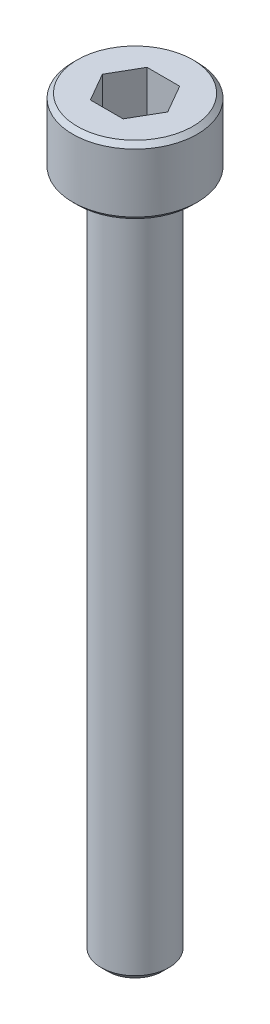
ISO-10303-21;
HEADER;
FILE_DESCRIPTION(('STEP AP214'),'2;1');
FILE_NAME('part.step','',(''),(''),'','','');
FILE_SCHEMA(('AUTOMOTIVE_DESIGN { 1 0 10303 214 1 1 1 1 }'));
ENDSEC;
DATA;
#1=APPLICATION_CONTEXT('core data for automotive mechanical design processes');
#2=APPLICATION_PROTOCOL_DEFINITION('international standard','automotive_design',2000,#1);
#3=PRODUCT_CONTEXT('',#1,'mechanical');
#4=PRODUCT('Part','Part','',(#3));
#5=PRODUCT_RELATED_PRODUCT_CATEGORY('part','',(#4));
#6=PRODUCT_DEFINITION_FORMATION('','',#4);
#7=PRODUCT_DEFINITION_CONTEXT('part definition',#1,'design');
#8=PRODUCT_DEFINITION('design','',#6,#7);
#9=PRODUCT_DEFINITION_SHAPE('','',#8);
#10=(LENGTH_UNIT() NAMED_UNIT(*) SI_UNIT(.MILLI.,.METRE.));
#11=(NAMED_UNIT(*) PLANE_ANGLE_UNIT() SI_UNIT($,.RADIAN.));
#12=(NAMED_UNIT(*) SI_UNIT($,.STERADIAN.) SOLID_ANGLE_UNIT());
#13=UNCERTAINTY_MEASURE_WITH_UNIT(LENGTH_MEASURE(1.E-05),#10,'distance_accuracy_value','');
#14=(GEOMETRIC_REPRESENTATION_CONTEXT(3) GLOBAL_UNCERTAINTY_ASSIGNED_CONTEXT((#13)) GLOBAL_UNIT_ASSIGNED_CONTEXT((#10,
#11,#12)) REPRESENTATION_CONTEXT('',''));
#15=CARTESIAN_POINT('',(0.,0.,0.));
#16=DIRECTION('',(0.,0.,1.));
#17=DIRECTION('',(1.,0.,0.));
#18=AXIS2_PLACEMENT_3D('',#15,#16,#17);
#19=CARTESIAN_POINT('',(0.721687836487033,31.,1.25));
#20=DIRECTION('',(0.866025403784439,0.,0.5));
#21=DIRECTION('',(0.5,0.,-0.866025403784439));
#22=AXIS2_PLACEMENT_3D('',#19,#20,#21);
#23=PLANE('',#22);
#24=DIRECTION('',(0.5,0.,-0.866025403784439));
#25=VECTOR('',#24,1.);
#26=CARTESIAN_POINT('',(0.721687836487033,31.,1.25));
#27=LINE('',#26,#25);
#28=CARTESIAN_POINT('',(0.721687836487033,31.,1.25));
#29=VERTEX_POINT('',#28);
#30=CARTESIAN_POINT('',(1.44337567297406,31.,0.));
#31=VERTEX_POINT('',#30);
#32=EDGE_CURVE('E66',#29,#31,#27,.T.);
#33=ORIENTED_EDGE('',*,*,#32,.F.);
#34=DIRECTION('',(0.,1.,0.));
#35=VECTOR('',#34,1.);
#36=CARTESIAN_POINT('',(0.721687836487033,31.,1.25));
#37=LINE('',#36,#35);
#38=CARTESIAN_POINT('',(0.721687836487033,33.,1.25));
#39=VERTEX_POINT('',#38);
#40=EDGE_CURVE('E85',#29,#39,#37,.T.);
#41=ORIENTED_EDGE('',*,*,#40,.T.);
#42=DIRECTION('',(0.5,0.,-0.866025403784439));
#43=VECTOR('',#42,1.);
#44=CARTESIAN_POINT('',(0.721687836487033,33.,1.25));
#45=LINE('',#44,#43);
#46=CARTESIAN_POINT('',(1.44337567297406,33.,0.));
#47=VERTEX_POINT('',#46);
#48=EDGE_CURVE('E73',#47,#39,#45,.F.);
#49=ORIENTED_EDGE('',*,*,#48,.F.);
#50=DIRECTION('',(0.,1.,0.));
#51=VECTOR('',#50,1.);
#52=CARTESIAN_POINT('',(1.44337567297406,31.,0.));
#53=LINE('',#52,#51);
#54=EDGE_CURVE('E80',#47,#31,#53,.F.);
#55=ORIENTED_EDGE('',*,*,#54,.T.);
#56=EDGE_LOOP('',(#33,#41,#49,#55));
#57=FACE_BOUND('',#56,.T.);
#58=ADVANCED_FACE('F17',(#57),#23,.F.);
#59=CARTESIAN_POINT('',(1.44337567297406,31.,0.));
#60=DIRECTION('',(0.866025403784438,0.,-0.5));
#61=DIRECTION('',(-0.5,0.,-0.866025403784438));
#62=AXIS2_PLACEMENT_3D('',#59,#60,#61);
#63=PLANE('',#62);
#64=DIRECTION('',(-0.5,0.,-0.866025403784438));
#65=VECTOR('',#64,1.);
#66=CARTESIAN_POINT('',(1.44337567297406,31.,0.));
#67=LINE('',#66,#65);
#68=CARTESIAN_POINT('',(0.721687836487031,31.,-1.25));
#69=VERTEX_POINT('',#68);
#70=EDGE_CURVE('E89',#31,#69,#67,.T.);
#71=ORIENTED_EDGE('',*,*,#70,.F.);
#72=ORIENTED_EDGE('',*,*,#54,.F.);
#73=DIRECTION('',(-0.5,0.,-0.866025403784438));
#74=VECTOR('',#73,1.);
#75=CARTESIAN_POINT('',(1.44337567297406,33.,0.));
#76=LINE('',#75,#74);
#77=CARTESIAN_POINT('',(0.721687836487032,33.,-1.25));
#78=VERTEX_POINT('',#77);
#79=EDGE_CURVE('E70',#78,#47,#76,.F.);
#80=ORIENTED_EDGE('',*,*,#79,.F.);
#81=DIRECTION('',(0.,1.,0.));
#82=VECTOR('',#81,1.);
#83=CARTESIAN_POINT('',(0.721687836487031,31.,-1.25));
#84=LINE('',#83,#82);
#85=EDGE_CURVE('E133',#78,#69,#84,.F.);
#86=ORIENTED_EDGE('',*,*,#85,.T.);
#87=EDGE_LOOP('',(#71,#72,#80,#86));
#88=FACE_BOUND('',#87,.T.);
#89=ADVANCED_FACE('F88',(#88),#63,.F.);
#90=CARTESIAN_POINT('',(-0.721687836487032,31.,1.25));
#91=DIRECTION('',(0.,0.,1.));
#92=DIRECTION('',(1.,0.,0.));
#93=AXIS2_PLACEMENT_3D('',#90,#91,#92);
#94=PLANE('',#93);
#95=DIRECTION('',(1.,0.,0.));
#96=VECTOR('',#95,1.);
#97=CARTESIAN_POINT('',(1.44337567297406,31.,1.25));
#98=LINE('',#97,#96);
#99=CARTESIAN_POINT('',(-0.721687836487032,31.,1.25));
#100=VERTEX_POINT('',#99);
#101=EDGE_CURVE('E131',#100,#29,#98,.T.);
#102=ORIENTED_EDGE('',*,*,#101,.F.);
#103=DIRECTION('',(0.,1.,0.));
#104=VECTOR('',#103,1.);
#105=CARTESIAN_POINT('',(-0.721687836487032,31.,1.25));
#106=LINE('',#105,#104);
#107=CARTESIAN_POINT('',(-0.721687836487032,33.,1.25));
#108=VERTEX_POINT('',#107);
#109=EDGE_CURVE('E121',#100,#108,#106,.T.);
#110=ORIENTED_EDGE('',*,*,#109,.T.);
#111=DIRECTION('',(1.,0.,0.));
#112=VECTOR('',#111,1.);
#113=CARTESIAN_POINT('',(-0.721687836487032,33.,1.25));
#114=LINE('',#113,#112);
#115=EDGE_CURVE('E91',#39,#108,#114,.F.);
#116=ORIENTED_EDGE('',*,*,#115,.F.);
#117=ORIENTED_EDGE('',*,*,#40,.F.);
#118=EDGE_LOOP('',(#102,#110,#116,#117));
#119=FACE_BOUND('',#118,.T.);
#120=ADVANCED_FACE('F138',(#119),#94,.F.);
#121=CARTESIAN_POINT('',(0.721687836487031,31.,-1.25));
#122=DIRECTION('',(0.,0.,-1.));
#123=DIRECTION('',(-1.,0.,0.));
#124=AXIS2_PLACEMENT_3D('',#121,#122,#123);
#125=PLANE('',#124);
#126=DIRECTION('',(1.,0.,0.));
#127=VECTOR('',#126,1.);
#128=CARTESIAN_POINT('',(1.44337567297406,31.,-1.25));
#129=LINE('',#128,#127);
#130=CARTESIAN_POINT('',(-0.721687836487032,31.,-1.25));
#131=VERTEX_POINT('',#130);
#132=EDGE_CURVE('E128',#69,#131,#129,.F.);
#133=ORIENTED_EDGE('',*,*,#132,.F.);
#134=ORIENTED_EDGE('',*,*,#85,.F.);
#135=DIRECTION('',(-1.,0.,0.));
#136=VECTOR('',#135,1.);
#137=CARTESIAN_POINT('',(0.721687836487031,33.,-1.25));
#138=LINE('',#137,#136);
#139=CARTESIAN_POINT('',(-0.721687836487032,33.,-1.25));
#140=VERTEX_POINT('',#139);
#141=EDGE_CURVE('E75',#140,#78,#138,.F.);
#142=ORIENTED_EDGE('',*,*,#141,.F.);
#143=DIRECTION('',(0.,1.,0.));
#144=VECTOR('',#143,1.);
#145=CARTESIAN_POINT('',(-0.721687836487032,31.,-1.25));
#146=LINE('',#145,#144);
#147=EDGE_CURVE('E119',#140,#131,#146,.F.);
#148=ORIENTED_EDGE('',*,*,#147,.T.);
#149=EDGE_LOOP('',(#133,#134,#142,#148));
#150=FACE_BOUND('',#149,.T.);
#151=ADVANCED_FACE('F150',(#150),#125,.F.);
#152=CARTESIAN_POINT('',(1.44337567297406,31.,0.));
#153=DIRECTION('',(0.,1.,0.));
#154=DIRECTION('',(0.,0.,1.));
#155=AXIS2_PLACEMENT_3D('',#152,#153,#154);
#156=PLANE('',#155);
#157=ORIENTED_EDGE('',*,*,#132,.T.);
#158=DIRECTION('',(-0.5,0.,0.866025403784439));
#159=VECTOR('',#158,1.);
#160=CARTESIAN_POINT('',(-0.721687836487032,31.,-1.25));
#161=LINE('',#160,#159);
#162=CARTESIAN_POINT('',(-1.44337567297406,31.,0.));
#163=VERTEX_POINT('',#162);
#164=EDGE_CURVE('E117',#131,#163,#161,.T.);
#165=ORIENTED_EDGE('',*,*,#164,.T.);
#166=DIRECTION('',(0.5,0.,0.866025403784438));
#167=VECTOR('',#166,1.);
#168=CARTESIAN_POINT('',(-1.44337567297406,31.,0.));
#169=LINE('',#168,#167);
#170=EDGE_CURVE('E124',#163,#100,#169,.T.);
#171=ORIENTED_EDGE('',*,*,#170,.T.);
#172=ORIENTED_EDGE('',*,*,#101,.T.);
#173=ORIENTED_EDGE('',*,*,#32,.T.);
#174=ORIENTED_EDGE('',*,*,#70,.T.);
#175=EDGE_LOOP('',(#157,#165,#171,#172,#173,#174));
#176=FACE_BOUND('',#175,.T.);
#177=ADVANCED_FACE('F151',(#176),#156,.T.);
#178=CARTESIAN_POINT('',(-1.44337567297406,31.,0.));
#179=DIRECTION('',(-0.866025403784438,0.,0.5));
#180=DIRECTION('',(0.5,0.,0.866025403784438));
#181=AXIS2_PLACEMENT_3D('',#178,#179,#180);
#182=PLANE('',#181);
#183=ORIENTED_EDGE('',*,*,#170,.F.);
#184=DIRECTION('',(0.,1.,0.));
#185=VECTOR('',#184,1.);
#186=CARTESIAN_POINT('',(-1.44337567297407,31.,0.));
#187=LINE('',#186,#185);
#188=CARTESIAN_POINT('',(-1.44337567297406,33.,0.));
#189=VERTEX_POINT('',#188);
#190=EDGE_CURVE('E115',#163,#189,#187,.T.);
#191=ORIENTED_EDGE('',*,*,#190,.T.);
#192=DIRECTION('',(0.5,0.,0.866025403784438));
#193=VECTOR('',#192,1.);
#194=CARTESIAN_POINT('',(-1.44337567297406,33.,0.));
#195=LINE('',#194,#193);
#196=EDGE_CURVE('E35',#108,#189,#195,.F.);
#197=ORIENTED_EDGE('',*,*,#196,.F.);
#198=ORIENTED_EDGE('',*,*,#109,.F.);
#199=EDGE_LOOP('',(#183,#191,#197,#198));
#200=FACE_BOUND('',#199,.T.);
#201=ADVANCED_FACE('F141',(#200),#182,.F.);
#202=CARTESIAN_POINT('',(-0.721687836487032,31.,-1.25));
#203=DIRECTION('',(-0.866025403784439,0.,-0.5));
#204=DIRECTION('',(-0.5,0.,0.866025403784439));
#205=AXIS2_PLACEMENT_3D('',#202,#203,#204);
#206=PLANE('',#205);
#207=ORIENTED_EDGE('',*,*,#164,.F.);
#208=ORIENTED_EDGE('',*,*,#147,.F.);
#209=DIRECTION('',(0.5,0.,-0.866025403784438));
#210=VECTOR('',#209,1.);
#211=CARTESIAN_POINT('',(-1.44337567297406,33.,0.));
#212=LINE('',#211,#210);
#213=EDGE_CURVE('E113',#189,#140,#212,.T.);
#214=ORIENTED_EDGE('',*,*,#213,.F.);
#215=ORIENTED_EDGE('',*,*,#190,.F.);
#216=EDGE_LOOP('',(#207,#208,#214,#215));
#217=FACE_BOUND('',#216,.T.);
#218=ADVANCED_FACE('F147',(#217),#206,.F.);
#219=CARTESIAN_POINT('',(0.,33.,-2.75));
#220=DIRECTION('',(0.,1.,0.));
#221=DIRECTION('',(0.,0.,1.));
#222=AXIS2_PLACEMENT_3D('',#219,#220,#221);
#223=PLANE('',#222);
#224=CARTESIAN_POINT('',(0.,33.0000000000155,0.));
#225=DIRECTION('',(0.,-1.,0.));
#226=DIRECTION('',(0.,0.,-1.));
#227=AXIS2_PLACEMENT_3D('',#224,#225,#226);
#228=CIRCLE('',#227,2.54999999992833);
#229=CARTESIAN_POINT('',(0.,33.0000000000155,-2.54999999992833));
#230=VERTEX_POINT('',#229);
#231=EDGE_CURVE('E20',#230,#230,#228,.T.);
#232=ORIENTED_EDGE('',*,*,#231,.F.);
#233=EDGE_LOOP('',(#232));
#234=FACE_BOUND('',#233,.T.);
#235=ORIENTED_EDGE('',*,*,#196,.T.);
#236=ORIENTED_EDGE('',*,*,#213,.T.);
#237=ORIENTED_EDGE('',*,*,#141,.T.);
#238=ORIENTED_EDGE('',*,*,#79,.T.);
#239=ORIENTED_EDGE('',*,*,#48,.T.);
#240=ORIENTED_EDGE('',*,*,#115,.T.);
#241=EDGE_LOOP('',(#235,#236,#237,#238,#239,#240));
#242=FACE_BOUND('',#241,.T.);
#243=ADVANCED_FACE('F72',(#234,#242),#223,.T.);
#244=CARTESIAN_POINT('',(0.,32.8000000000657,0.));
#245=DIRECTION('',(0.,-1.,0.));
#246=DIRECTION('',(0.,0.,-1.));
#247=AXIS2_PLACEMENT_3D('',#244,#245,#246);
#248=CONICAL_SURFACE('',#247,2.74999999987813,0.785398163397448);
#249=CARTESIAN_POINT('',(0.,32.8,0.));
#250=DIRECTION('',(0.,-1.,0.));
#251=DIRECTION('',(0.,0.,-1.));
#252=AXIS2_PLACEMENT_3D('',#249,#250,#251);
#253=CIRCLE('',#252,2.75);
#254=CARTESIAN_POINT('',(0.,32.8,-2.75));
#255=VERTEX_POINT('',#254);
#256=EDGE_CURVE('E106',#255,#255,#253,.T.);
#257=ORIENTED_EDGE('',*,*,#256,.F.);
#258=EDGE_LOOP('',(#257));
#259=FACE_BOUND('',#258,.T.);
#260=ORIENTED_EDGE('',*,*,#231,.T.);
#261=EDGE_LOOP('',(#260));
#262=FACE_BOUND('',#261,.T.);
#263=ADVANCED_FACE('F186',(#259,#262),#248,.T.);
#264=CARTESIAN_POINT('',(0.,0.,0.));
#265=DIRECTION('',(0.,-1.,0.));
#266=DIRECTION('',(0.,0.,-1.));
#267=AXIS2_PLACEMENT_3D('',#264,#265,#266);
#268=CYLINDRICAL_SURFACE('',#267,2.75);
#269=CARTESIAN_POINT('',(0.,30.1999999999794,0.));
#270=DIRECTION('',(0.,1.,0.));
#271=DIRECTION('',(0.,0.,1.));
#272=AXIS2_PLACEMENT_3D('',#269,#270,#271);
#273=CIRCLE('',#272,2.75000000004866);
#274=CARTESIAN_POINT('',(0.,30.1999999999794,2.75000000004866));
#275=VERTEX_POINT('',#274);
#276=EDGE_CURVE('E102',#275,#275,#273,.F.);
#277=ORIENTED_EDGE('',*,*,#276,.F.);
#278=EDGE_LOOP('',(#277));
#279=FACE_BOUND('',#278,.T.);
#280=ORIENTED_EDGE('',*,*,#256,.T.);
#281=EDGE_LOOP('',(#280));
#282=FACE_BOUND('',#281,.T.);
#283=ADVANCED_FACE('F183',(#279,#282),#268,.T.);
#284=CARTESIAN_POINT('',(0.,30.1999999999225,0.));
#285=DIRECTION('',(0.,1.,0.));
#286=DIRECTION('',(0.,0.,1.));
#287=AXIS2_PLACEMENT_3D('',#284,#285,#286);
#288=CONICAL_SURFACE('',#287,2.74999999999181,0.785398163397448);
#289=ORIENTED_EDGE('',*,*,#276,.T.);
#290=EDGE_LOOP('',(#289));
#291=FACE_BOUND('',#290,.T.);
#292=CARTESIAN_POINT('',(0.,29.9999999999727,0.));
#293=DIRECTION('',(0.,1.,0.));
#294=DIRECTION('',(0.,0.,1.));
#295=AXIS2_PLACEMENT_3D('',#292,#293,#294);
#296=CIRCLE('',#295,2.55000000004202);
#297=CARTESIAN_POINT('',(0.,29.9999999999727,2.55000000004202));
#298=VERTEX_POINT('',#297);
#299=EDGE_CURVE('E100',#298,#298,#296,.F.);
#300=ORIENTED_EDGE('',*,*,#299,.F.);
#301=EDGE_LOOP('',(#300));
#302=FACE_BOUND('',#301,.T.);
#303=ADVANCED_FACE('F179',(#291,#302),#288,.T.);
#304=CARTESIAN_POINT('',(0.,0.,0.));
#305=DIRECTION('',(0.,-1.,0.));
#306=DIRECTION('',(0.,0.,-1.));
#307=AXIS2_PLACEMENT_3D('',#304,#305,#306);
#308=PLANE('',#307);
#309=CARTESIAN_POINT('',(0.,5.6843418860808E-11,0.));
#310=DIRECTION('',(0.,1.,0.));
#311=DIRECTION('',(0.,0.,1.));
#312=AXIS2_PLACEMENT_3D('',#309,#310,#311);
#313=CIRCLE('',#312,1.19999999992615);
#314=CARTESIAN_POINT('',(0.,5.6843418860808E-11,1.19999999992615));
#315=VERTEX_POINT('',#314);
#316=EDGE_CURVE('E98',#315,#315,#313,.T.);
#317=ORIENTED_EDGE('',*,*,#316,.F.);
#318=EDGE_LOOP('',(#317));
#319=FACE_BOUND('',#318,.T.);
#320=ADVANCED_FACE('F176',(#319),#308,.T.);
#321=CARTESIAN_POINT('',(0.,30.,-1.5));
#322=DIRECTION('',(0.,-1.,0.));
#323=DIRECTION('',(0.,0.,-1.));
#324=AXIS2_PLACEMENT_3D('',#321,#322,#323);
#325=PLANE('',#324);
#326=ORIENTED_EDGE('',*,*,#299,.T.);
#327=EDGE_LOOP('',(#326));
#328=FACE_BOUND('',#327,.T.);
#329=CARTESIAN_POINT('',(0.,30.,0.));
#330=DIRECTION('',(0.,-1.,0.));
#331=DIRECTION('',(0.,0.,-1.));
#332=AXIS2_PLACEMENT_3D('',#329,#330,#331);
#333=CIRCLE('',#332,1.5);
#334=CARTESIAN_POINT('',(0.,30.,-1.5));
#335=VERTEX_POINT('',#334);
#336=EDGE_CURVE('E26',#335,#335,#333,.T.);
#337=ORIENTED_EDGE('',*,*,#336,.F.);
#338=EDGE_LOOP('',(#337));
#339=FACE_BOUND('',#338,.T.);
#340=ADVANCED_FACE('F169',(#328,#339),#325,.T.);
#341=CARTESIAN_POINT('',(0.,0.300000000038381,0.));
#342=DIRECTION('',(0.,1.,0.));
#343=DIRECTION('',(0.,0.,1.));
#344=AXIS2_PLACEMENT_3D('',#341,#342,#343);
#345=CONICAL_SURFACE('',#344,1.49999999990769,0.785398163397448);
#346=CARTESIAN_POINT('',(0.,0.299999999999999,0.));
#347=DIRECTION('',(0.,-1.,0.));
#348=DIRECTION('',(0.,0.,-1.));
#349=AXIS2_PLACEMENT_3D('',#346,#347,#348);
#350=CIRCLE('',#349,1.5);
#351=CARTESIAN_POINT('',(0.,0.299999999999999,-1.5));
#352=VERTEX_POINT('',#351);
#353=EDGE_CURVE('E11',#352,#352,#350,.F.);
#354=ORIENTED_EDGE('',*,*,#353,.F.);
#355=EDGE_LOOP('',(#354));
#356=FACE_BOUND('',#355,.T.);
#357=ORIENTED_EDGE('',*,*,#316,.T.);
#358=EDGE_LOOP('',(#357));
#359=FACE_BOUND('',#358,.T.);
#360=ADVANCED_FACE('F163',(#356,#359),#345,.T.);
#361=CARTESIAN_POINT('',(0.,0.,0.));
#362=DIRECTION('',(0.,-1.,0.));
#363=DIRECTION('',(0.,0.,-1.));
#364=AXIS2_PLACEMENT_3D('',#361,#362,#363);
#365=CYLINDRICAL_SURFACE('',#364,1.5);
#366=ORIENTED_EDGE('',*,*,#353,.T.);
#367=EDGE_LOOP('',(#366));
#368=FACE_BOUND('',#367,.T.);
#369=ORIENTED_EDGE('',*,*,#336,.T.);
#370=EDGE_LOOP('',(#369));
#371=FACE_BOUND('',#370,.T.);
#372=ADVANCED_FACE('F161',(#368,#371),#365,.T.);
#373=CLOSED_SHELL('',(#58,#89,#120,#151,#177,#201,#218,#243,#263,#283,#303,#320,#340,#360,#372));
#374=MANIFOLD_SOLID_BREP('B1',#373);
#375=ADVANCED_BREP_SHAPE_REPRESENTATION('',(#18,#374),#14);
#376=SHAPE_DEFINITION_REPRESENTATION(#9,#375);
ENDSEC;
END-ISO-10303-21;
